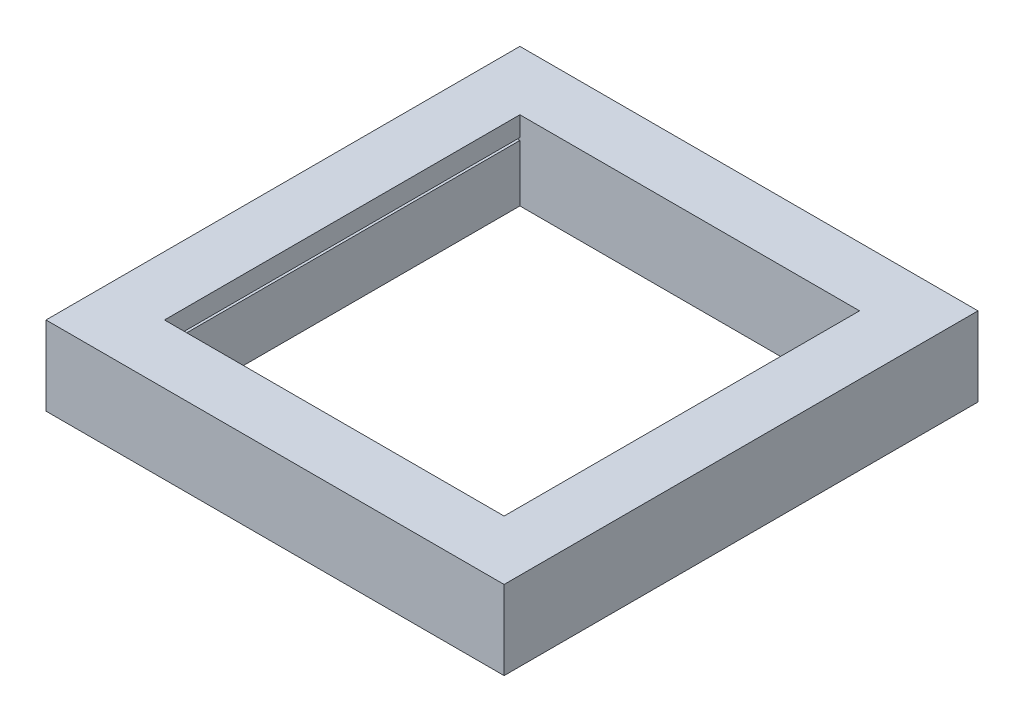
ISO-10303-21;
HEADER;
FILE_DESCRIPTION(('STEP AP214'),'2;1');
FILE_NAME('part.step','',(''),(''),'','','');
FILE_SCHEMA(('AUTOMOTIVE_DESIGN { 1 0 10303 214 1 1 1 1 }'));
ENDSEC;
DATA;
#1=APPLICATION_CONTEXT('core data for automotive mechanical design processes');
#2=APPLICATION_PROTOCOL_DEFINITION('international standard','automotive_design',2000,#1);
#3=PRODUCT_CONTEXT('',#1,'mechanical');
#4=PRODUCT('Part','Part','',(#3));
#5=PRODUCT_RELATED_PRODUCT_CATEGORY('part','',(#4));
#6=PRODUCT_DEFINITION_FORMATION('','',#4);
#7=PRODUCT_DEFINITION_CONTEXT('part definition',#1,'design');
#8=PRODUCT_DEFINITION('design','',#6,#7);
#9=PRODUCT_DEFINITION_SHAPE('','',#8);
#10=(LENGTH_UNIT() NAMED_UNIT(*) SI_UNIT(.MILLI.,.METRE.));
#11=(NAMED_UNIT(*) PLANE_ANGLE_UNIT() SI_UNIT($,.RADIAN.));
#12=(NAMED_UNIT(*) SI_UNIT($,.STERADIAN.) SOLID_ANGLE_UNIT());
#13=UNCERTAINTY_MEASURE_WITH_UNIT(LENGTH_MEASURE(1.E-05),#10,'distance_accuracy_value','');
#14=(GEOMETRIC_REPRESENTATION_CONTEXT(3) GLOBAL_UNCERTAINTY_ASSIGNED_CONTEXT((#13)) GLOBAL_UNIT_ASSIGNED_CONTEXT((#10,
#11,#12)) REPRESENTATION_CONTEXT('',''));
#15=CARTESIAN_POINT('',(0.,0.,0.));
#16=DIRECTION('',(0.,0.,1.));
#17=DIRECTION('',(1.,0.,0.));
#18=AXIS2_PLACEMENT_3D('',#15,#16,#17);
#19=CARTESIAN_POINT('',(109.22,50.8,0.));
#20=DIRECTION('',(-1.,0.,0.));
#21=DIRECTION('',(0.,0.,1.));
#22=AXIS2_PLACEMENT_3D('',#19,#20,#21);
#23=PLANE('',#22);
#24=DIRECTION('',(0.,-1.,0.));
#25=VECTOR('',#24,1.);
#26=CARTESIAN_POINT('',(109.22,50.8,114.3));
#27=LINE('',#26,#25);
#28=CARTESIAN_POINT('',(109.22,36.4998,114.3));
#29=VERTEX_POINT('',#28);
#30=CARTESIAN_POINT('',(109.22,0.,114.3));
#31=VERTEX_POINT('',#30);
#32=EDGE_CURVE('E265',#29,#31,#27,.T.);
#33=ORIENTED_EDGE('',*,*,#32,.F.);
#34=DIRECTION('',(0.,0.,-1.));
#35=VECTOR('',#34,1.);
#36=CARTESIAN_POINT('',(109.22,36.4998,114.3));
#37=LINE('',#36,#35);
#38=CARTESIAN_POINT('',(109.22,36.4998,-114.3));
#39=VERTEX_POINT('',#38);
#40=EDGE_CURVE('E169',#29,#39,#37,.T.);
#41=ORIENTED_EDGE('',*,*,#40,.T.);
#42=DIRECTION('',(0.,-1.,0.));
#43=VECTOR('',#42,1.);
#44=CARTESIAN_POINT('',(109.22,50.8,-114.3));
#45=LINE('',#44,#43);
#46=CARTESIAN_POINT('',(109.22,0.,-114.3));
#47=VERTEX_POINT('',#46);
#48=EDGE_CURVE('E228',#39,#47,#45,.T.);
#49=ORIENTED_EDGE('',*,*,#48,.T.);
#50=DIRECTION('',(0.,0.,-1.));
#51=VECTOR('',#50,1.);
#52=CARTESIAN_POINT('',(109.22,0.,0.));
#53=LINE('',#52,#51);
#54=EDGE_CURVE('E201',#31,#47,#53,.T.);
#55=ORIENTED_EDGE('',*,*,#54,.F.);
#56=EDGE_LOOP('',(#33,#41,#49,#55));
#57=FACE_BOUND('',#56,.T.);
#58=ADVANCED_FACE('F34',(#57),#23,.T.);
#59=CARTESIAN_POINT('',(109.22,50.8,-114.3));
#60=VERTEX_POINT('',#59);
#61=CARTESIAN_POINT('',(109.22,38.1,-114.3));
#62=VERTEX_POINT('',#61);
#63=EDGE_CURVE('E256',#60,#62,#45,.T.);
#64=ORIENTED_EDGE('',*,*,#63,.T.);
#65=DIRECTION('',(0.,0.,1.));
#66=VECTOR('',#65,1.);
#67=CARTESIAN_POINT('',(109.22,38.1,114.3));
#68=LINE('',#67,#66);
#69=CARTESIAN_POINT('',(109.22,38.1,114.3));
#70=VERTEX_POINT('',#69);
#71=EDGE_CURVE('E50',#62,#70,#68,.T.);
#72=ORIENTED_EDGE('',*,*,#71,.T.);
#73=CARTESIAN_POINT('',(109.22,50.8,114.3));
#74=VERTEX_POINT('',#73);
#75=EDGE_CURVE('E37',#74,#70,#27,.T.);
#76=ORIENTED_EDGE('',*,*,#75,.F.);
#77=DIRECTION('',(0.,0.,-1.));
#78=VECTOR('',#77,1.);
#79=CARTESIAN_POINT('',(109.22,50.8,0.));
#80=LINE('',#79,#78);
#81=EDGE_CURVE('E207',#74,#60,#80,.T.);
#82=ORIENTED_EDGE('',*,*,#81,.T.);
#83=EDGE_LOOP('',(#64,#72,#76,#82));
#84=FACE_BOUND('',#83,.T.);
#85=ADVANCED_FACE('F302',(#84),#23,.T.);
#86=CARTESIAN_POINT('',(-109.22,50.8,0.));
#87=DIRECTION('',(1.,0.,0.));
#88=DIRECTION('',(0.,0.,-1.));
#89=AXIS2_PLACEMENT_3D('',#86,#87,#88);
#90=PLANE('',#89);
#91=DIRECTION('',(0.,0.,1.));
#92=VECTOR('',#91,1.);
#93=CARTESIAN_POINT('',(-109.22,38.1,114.3));
#94=LINE('',#93,#92);
#95=CARTESIAN_POINT('',(-109.22,38.1,-114.3));
#96=VERTEX_POINT('',#95);
#97=CARTESIAN_POINT('',(-109.22,38.1,114.3));
#98=VERTEX_POINT('',#97);
#99=EDGE_CURVE('E186',#96,#98,#94,.T.);
#100=ORIENTED_EDGE('',*,*,#99,.F.);
#101=DIRECTION('',(0.,-1.,0.));
#102=VECTOR('',#101,1.);
#103=CARTESIAN_POINT('',(-109.22,50.8,-114.3));
#104=LINE('',#103,#102);
#105=CARTESIAN_POINT('',(-109.22,50.8,-114.3));
#106=VERTEX_POINT('',#105);
#107=EDGE_CURVE('E260',#106,#96,#104,.T.);
#108=ORIENTED_EDGE('',*,*,#107,.F.);
#109=DIRECTION('',(0.,0.,1.));
#110=VECTOR('',#109,1.);
#111=CARTESIAN_POINT('',(-109.22,50.8,0.));
#112=LINE('',#111,#110);
#113=CARTESIAN_POINT('',(-109.22,50.8,114.3));
#114=VERTEX_POINT('',#113);
#115=EDGE_CURVE('E213',#106,#114,#112,.T.);
#116=ORIENTED_EDGE('',*,*,#115,.T.);
#117=DIRECTION('',(0.,-1.,0.));
#118=VECTOR('',#117,1.);
#119=CARTESIAN_POINT('',(-109.22,50.8,114.3));
#120=LINE('',#119,#118);
#121=EDGE_CURVE('E263',#114,#98,#120,.T.);
#122=ORIENTED_EDGE('',*,*,#121,.T.);
#123=EDGE_LOOP('',(#100,#108,#116,#122));
#124=FACE_BOUND('',#123,.T.);
#125=ADVANCED_FACE('F293',(#124),#90,.T.);
#126=CARTESIAN_POINT('',(0.,50.8,152.4));
#127=DIRECTION('',(0.,0.,-1.));
#128=DIRECTION('',(-1.,0.,0.));
#129=AXIS2_PLACEMENT_3D('',#126,#127,#128);
#130=PLANE('',#129);
#131=DIRECTION('',(1.,0.,0.));
#132=VECTOR('',#131,1.);
#133=CARTESIAN_POINT('',(0.,0.,152.4));
#134=LINE('',#133,#132);
#135=CARTESIAN_POINT('',(-147.32,0.,152.4));
#136=VERTEX_POINT('',#135);
#137=CARTESIAN_POINT('',(147.32,0.,152.4));
#138=VERTEX_POINT('',#137);
#139=EDGE_CURVE('E240',#136,#138,#134,.T.);
#140=ORIENTED_EDGE('',*,*,#139,.T.);
#141=DIRECTION('',(0.,-1.,0.));
#142=VECTOR('',#141,1.);
#143=CARTESIAN_POINT('',(147.32,50.8,152.4));
#144=LINE('',#143,#142);
#145=CARTESIAN_POINT('',(147.32,50.8,152.4));
#146=VERTEX_POINT('',#145);
#147=EDGE_CURVE('E11',#146,#138,#144,.T.);
#148=ORIENTED_EDGE('',*,*,#147,.F.);
#149=DIRECTION('',(1.,0.,0.));
#150=VECTOR('',#149,1.);
#151=CARTESIAN_POINT('',(0.,50.8,152.4));
#152=LINE('',#151,#150);
#153=CARTESIAN_POINT('',(-147.32,50.8,152.4));
#154=VERTEX_POINT('',#153);
#155=EDGE_CURVE('E218',#154,#146,#152,.T.);
#156=ORIENTED_EDGE('',*,*,#155,.F.);
#157=DIRECTION('',(0.,-1.,0.));
#158=VECTOR('',#157,1.);
#159=CARTESIAN_POINT('',(-147.32,50.8,152.4));
#160=LINE('',#159,#158);
#161=EDGE_CURVE('E250',#154,#136,#160,.T.);
#162=ORIENTED_EDGE('',*,*,#161,.T.);
#163=EDGE_LOOP('',(#140,#148,#156,#162));
#164=FACE_BOUND('',#163,.T.);
#165=ADVANCED_FACE('F308',(#164),#130,.F.);
#166=CARTESIAN_POINT('',(147.32,50.8,0.));
#167=DIRECTION('',(-1.,0.,0.));
#168=DIRECTION('',(0.,0.,1.));
#169=AXIS2_PLACEMENT_3D('',#166,#167,#168);
#170=PLANE('',#169);
#171=DIRECTION('',(0.,0.,-1.));
#172=VECTOR('',#171,1.);
#173=CARTESIAN_POINT('',(147.32,0.,0.));
#174=LINE('',#173,#172);
#175=CARTESIAN_POINT('',(147.32,0.,-152.4));
#176=VERTEX_POINT('',#175);
#177=EDGE_CURVE('E243',#138,#176,#174,.T.);
#178=ORIENTED_EDGE('',*,*,#177,.T.);
#179=DIRECTION('',(0.,-1.,0.));
#180=VECTOR('',#179,1.);
#181=CARTESIAN_POINT('',(147.32,50.8,-152.4));
#182=LINE('',#181,#180);
#183=CARTESIAN_POINT('',(147.32,50.8,-152.4));
#184=VERTEX_POINT('',#183);
#185=EDGE_CURVE('E42',#184,#176,#182,.T.);
#186=ORIENTED_EDGE('',*,*,#185,.F.);
#187=DIRECTION('',(0.,0.,-1.));
#188=VECTOR('',#187,1.);
#189=CARTESIAN_POINT('',(147.32,50.8,0.));
#190=LINE('',#189,#188);
#191=EDGE_CURVE('E221',#146,#184,#190,.T.);
#192=ORIENTED_EDGE('',*,*,#191,.F.);
#193=ORIENTED_EDGE('',*,*,#147,.T.);
#194=EDGE_LOOP('',(#178,#186,#192,#193));
#195=FACE_BOUND('',#194,.T.);
#196=ADVANCED_FACE('F340',(#195),#170,.F.);
#197=CARTESIAN_POINT('',(0.,50.8,-152.4));
#198=DIRECTION('',(0.,0.,-1.));
#199=DIRECTION('',(-1.,0.,0.));
#200=AXIS2_PLACEMENT_3D('',#197,#198,#199);
#201=PLANE('',#200);
#202=DIRECTION('',(1.,0.,0.));
#203=VECTOR('',#202,1.);
#204=CARTESIAN_POINT('',(0.,0.,-152.4));
#205=LINE('',#204,#203);
#206=CARTESIAN_POINT('',(-147.32,0.,-152.4));
#207=VERTEX_POINT('',#206);
#208=EDGE_CURVE('E246',#207,#176,#205,.T.);
#209=ORIENTED_EDGE('',*,*,#208,.F.);
#210=DIRECTION('',(0.,-1.,0.));
#211=VECTOR('',#210,1.);
#212=CARTESIAN_POINT('',(-147.32,50.8,-152.4));
#213=LINE('',#212,#211);
#214=CARTESIAN_POINT('',(-147.32,50.8,-152.4));
#215=VERTEX_POINT('',#214);
#216=EDGE_CURVE('E253',#215,#207,#213,.T.);
#217=ORIENTED_EDGE('',*,*,#216,.F.);
#218=DIRECTION('',(1.,0.,0.));
#219=VECTOR('',#218,1.);
#220=CARTESIAN_POINT('',(0.,50.8,-152.4));
#221=LINE('',#220,#219);
#222=EDGE_CURVE('E223',#215,#184,#221,.T.);
#223=ORIENTED_EDGE('',*,*,#222,.T.);
#224=ORIENTED_EDGE('',*,*,#185,.T.);
#225=EDGE_LOOP('',(#209,#217,#223,#224));
#226=FACE_BOUND('',#225,.T.);
#227=ADVANCED_FACE('F337',(#226),#201,.T.);
#228=CARTESIAN_POINT('',(0.,50.8,114.3));
#229=DIRECTION('',(0.,0.,-1.));
#230=DIRECTION('',(-1.,0.,0.));
#231=AXIS2_PLACEMENT_3D('',#228,#229,#230);
#232=PLANE('',#231);
#233=DIRECTION('',(1.,0.,0.));
#234=VECTOR('',#233,1.);
#235=CARTESIAN_POINT('',(0.,0.,114.3));
#236=LINE('',#235,#234);
#237=CARTESIAN_POINT('',(-109.22,0.,114.3));
#238=VERTEX_POINT('',#237);
#239=EDGE_CURVE('E231',#238,#31,#236,.T.);
#240=ORIENTED_EDGE('',*,*,#239,.F.);
#241=CARTESIAN_POINT('',(-109.22,36.4998,114.3));
#242=VERTEX_POINT('',#241);
#243=EDGE_CURVE('E262',#242,#238,#120,.T.);
#244=ORIENTED_EDGE('',*,*,#243,.F.);
#245=DIRECTION('',(1.,0.,0.));
#246=VECTOR('',#245,1.);
#247=CARTESIAN_POINT('',(-114.3,36.4998,114.3));
#248=LINE('',#247,#246);
#249=CARTESIAN_POINT('',(-114.3,36.4998,114.3));
#250=VERTEX_POINT('',#249);
#251=EDGE_CURVE('E195',#250,#242,#248,.T.);
#252=ORIENTED_EDGE('',*,*,#251,.F.);
#253=DIRECTION('',(0.,-1.,0.));
#254=VECTOR('',#253,1.);
#255=CARTESIAN_POINT('',(-114.3,38.1,114.3));
#256=LINE('',#255,#254);
#257=CARTESIAN_POINT('',(-114.3,38.1,114.3));
#258=VERTEX_POINT('',#257);
#259=EDGE_CURVE('E182',#258,#250,#256,.T.);
#260=ORIENTED_EDGE('',*,*,#259,.F.);
#261=DIRECTION('',(1.,0.,0.));
#262=VECTOR('',#261,1.);
#263=CARTESIAN_POINT('',(-114.3,38.1,114.3));
#264=LINE('',#263,#262);
#265=EDGE_CURVE('E199',#258,#98,#264,.T.);
#266=ORIENTED_EDGE('',*,*,#265,.T.);
#267=ORIENTED_EDGE('',*,*,#121,.F.);
#268=DIRECTION('',(1.,0.,0.));
#269=VECTOR('',#268,1.);
#270=CARTESIAN_POINT('',(0.,50.8,114.3));
#271=LINE('',#270,#269);
#272=EDGE_CURVE('E210',#114,#74,#271,.T.);
#273=ORIENTED_EDGE('',*,*,#272,.T.);
#274=ORIENTED_EDGE('',*,*,#75,.T.);
#275=DIRECTION('',(-1.,0.,0.));
#276=VECTOR('',#275,1.);
#277=CARTESIAN_POINT('',(114.3,38.1,114.3));
#278=LINE('',#277,#276);
#279=CARTESIAN_POINT('',(114.3,38.1,114.3));
#280=VERTEX_POINT('',#279);
#281=EDGE_CURVE('E150',#280,#70,#278,.T.);
#282=ORIENTED_EDGE('',*,*,#281,.F.);
#283=DIRECTION('',(0.,-1.,0.));
#284=VECTOR('',#283,1.);
#285=CARTESIAN_POINT('',(114.3,38.1,114.3));
#286=LINE('',#285,#284);
#287=CARTESIAN_POINT('',(114.3,36.4998,114.3));
#288=VERTEX_POINT('',#287);
#289=EDGE_CURVE('E156',#280,#288,#286,.T.);
#290=ORIENTED_EDGE('',*,*,#289,.T.);
#291=DIRECTION('',(-1.,0.,0.));
#292=VECTOR('',#291,1.);
#293=CARTESIAN_POINT('',(114.3,36.4998,114.3));
#294=LINE('',#293,#292);
#295=EDGE_CURVE('E177',#288,#29,#294,.T.);
#296=ORIENTED_EDGE('',*,*,#295,.T.);
#297=ORIENTED_EDGE('',*,*,#32,.T.);
#298=EDGE_LOOP('',(#240,#244,#252,#260,#266,#267,#273,#274,#282,#290,#296,#297));
#299=FACE_BOUND('',#298,.T.);
#300=ADVANCED_FACE('F162',(#299),#232,.T.);
#301=DIRECTION('',(0.,0.,-1.));
#302=VECTOR('',#301,1.);
#303=CARTESIAN_POINT('',(-109.22,36.4998,114.3));
#304=LINE('',#303,#302);
#305=CARTESIAN_POINT('',(-109.22,36.4998,-114.3));
#306=VERTEX_POINT('',#305);
#307=EDGE_CURVE('E58',#242,#306,#304,.T.);
#308=ORIENTED_EDGE('',*,*,#307,.F.);
#309=ORIENTED_EDGE('',*,*,#243,.T.);
#310=DIRECTION('',(0.,0.,1.));
#311=VECTOR('',#310,1.);
#312=CARTESIAN_POINT('',(-109.22,0.,0.));
#313=LINE('',#312,#311);
#314=CARTESIAN_POINT('',(-109.22,0.,-114.3));
#315=VERTEX_POINT('',#314);
#316=EDGE_CURVE('E234',#315,#238,#313,.T.);
#317=ORIENTED_EDGE('',*,*,#316,.F.);
#318=EDGE_CURVE('E259',#306,#315,#104,.T.);
#319=ORIENTED_EDGE('',*,*,#318,.F.);
#320=EDGE_LOOP('',(#308,#309,#317,#319));
#321=FACE_BOUND('',#320,.T.);
#322=ADVANCED_FACE('F271',(#321),#90,.T.);
#323=CARTESIAN_POINT('',(0.,50.8,-114.3));
#324=DIRECTION('',(0.,0.,-1.));
#325=DIRECTION('',(-1.,0.,0.));
#326=AXIS2_PLACEMENT_3D('',#323,#324,#325);
#327=PLANE('',#326);
#328=DIRECTION('',(1.,0.,0.));
#329=VECTOR('',#328,1.);
#330=CARTESIAN_POINT('',(0.,0.,-114.3));
#331=LINE('',#330,#329);
#332=EDGE_CURVE('E237',#315,#47,#331,.T.);
#333=ORIENTED_EDGE('',*,*,#332,.T.);
#334=ORIENTED_EDGE('',*,*,#48,.F.);
#335=DIRECTION('',(-1.,0.,0.));
#336=VECTOR('',#335,1.);
#337=CARTESIAN_POINT('',(114.3,36.4998,-114.3));
#338=LINE('',#337,#336);
#339=CARTESIAN_POINT('',(114.3,36.4998,-114.3));
#340=VERTEX_POINT('',#339);
#341=EDGE_CURVE('E179',#340,#39,#338,.T.);
#342=ORIENTED_EDGE('',*,*,#341,.F.);
#343=DIRECTION('',(0.,1.,0.));
#344=VECTOR('',#343,1.);
#345=CARTESIAN_POINT('',(114.3,38.1,-114.3));
#346=LINE('',#345,#344);
#347=CARTESIAN_POINT('',(114.3,38.1,-114.3));
#348=VERTEX_POINT('',#347);
#349=EDGE_CURVE('E155',#340,#348,#346,.T.);
#350=ORIENTED_EDGE('',*,*,#349,.T.);
#351=DIRECTION('',(-1.,0.,0.));
#352=VECTOR('',#351,1.);
#353=CARTESIAN_POINT('',(114.3,38.1,-114.3));
#354=LINE('',#353,#352);
#355=EDGE_CURVE('E151',#348,#62,#354,.T.);
#356=ORIENTED_EDGE('',*,*,#355,.T.);
#357=ORIENTED_EDGE('',*,*,#63,.F.);
#358=DIRECTION('',(1.,0.,0.));
#359=VECTOR('',#358,1.);
#360=CARTESIAN_POINT('',(0.,50.8,-114.3));
#361=LINE('',#360,#359);
#362=EDGE_CURVE('E216',#106,#60,#361,.T.);
#363=ORIENTED_EDGE('',*,*,#362,.F.);
#364=ORIENTED_EDGE('',*,*,#107,.T.);
#365=DIRECTION('',(1.,0.,0.));
#366=VECTOR('',#365,1.);
#367=CARTESIAN_POINT('',(-114.3,38.1,-114.3));
#368=LINE('',#367,#366);
#369=CARTESIAN_POINT('',(-114.3,38.1,-114.3));
#370=VERTEX_POINT('',#369);
#371=EDGE_CURVE('E202',#370,#96,#368,.T.);
#372=ORIENTED_EDGE('',*,*,#371,.F.);
#373=DIRECTION('',(0.,1.,0.));
#374=VECTOR('',#373,1.);
#375=CARTESIAN_POINT('',(-114.3,38.1,-114.3));
#376=LINE('',#375,#374);
#377=CARTESIAN_POINT('',(-114.3,36.4998,-114.3));
#378=VERTEX_POINT('',#377);
#379=EDGE_CURVE('E189',#378,#370,#376,.T.);
#380=ORIENTED_EDGE('',*,*,#379,.F.);
#381=DIRECTION('',(1.,0.,0.));
#382=VECTOR('',#381,1.);
#383=CARTESIAN_POINT('',(-114.3,36.4998,-114.3));
#384=LINE('',#383,#382);
#385=EDGE_CURVE('E204',#378,#306,#384,.T.);
#386=ORIENTED_EDGE('',*,*,#385,.T.);
#387=ORIENTED_EDGE('',*,*,#318,.T.);
#388=EDGE_LOOP('',(#333,#334,#342,#350,#356,#357,#363,#364,#372,#380,#386,#387));
#389=FACE_BOUND('',#388,.T.);
#390=ADVANCED_FACE('F281',(#389),#327,.F.);
#391=CARTESIAN_POINT('',(-147.32,50.8,0.));
#392=DIRECTION('',(1.,0.,0.));
#393=DIRECTION('',(0.,0.,-1.));
#394=AXIS2_PLACEMENT_3D('',#391,#392,#393);
#395=PLANE('',#394);
#396=DIRECTION('',(0.,0.,1.));
#397=VECTOR('',#396,1.);
#398=CARTESIAN_POINT('',(-147.32,0.,0.));
#399=LINE('',#398,#397);
#400=EDGE_CURVE('E211',#207,#136,#399,.T.);
#401=ORIENTED_EDGE('',*,*,#400,.T.);
#402=ORIENTED_EDGE('',*,*,#161,.F.);
#403=DIRECTION('',(0.,0.,1.));
#404=VECTOR('',#403,1.);
#405=CARTESIAN_POINT('',(-147.32,50.8,0.));
#406=LINE('',#405,#404);
#407=EDGE_CURVE('E226',#215,#154,#406,.T.);
#408=ORIENTED_EDGE('',*,*,#407,.F.);
#409=ORIENTED_EDGE('',*,*,#216,.T.);
#410=EDGE_LOOP('',(#401,#402,#408,#409));
#411=FACE_BOUND('',#410,.T.);
#412=ADVANCED_FACE('F331',(#411),#395,.F.);
#413=CARTESIAN_POINT('',(0.,50.8,0.));
#414=DIRECTION('',(0.,1.,0.));
#415=DIRECTION('',(0.,0.,1.));
#416=AXIS2_PLACEMENT_3D('',#413,#414,#415);
#417=PLANE('',#416);
#418=ORIENTED_EDGE('',*,*,#81,.F.);
#419=ORIENTED_EDGE('',*,*,#272,.F.);
#420=ORIENTED_EDGE('',*,*,#115,.F.);
#421=ORIENTED_EDGE('',*,*,#362,.T.);
#422=EDGE_LOOP('',(#418,#419,#420,#421));
#423=FACE_BOUND('',#422,.T.);
#424=ORIENTED_EDGE('',*,*,#155,.T.);
#425=ORIENTED_EDGE('',*,*,#191,.T.);
#426=ORIENTED_EDGE('',*,*,#222,.F.);
#427=ORIENTED_EDGE('',*,*,#407,.T.);
#428=EDGE_LOOP('',(#424,#425,#426,#427));
#429=FACE_BOUND('',#428,.T.);
#430=ADVANCED_FACE('F299',(#423,#429),#417,.T.);
#431=CARTESIAN_POINT('',(0.,0.,0.));
#432=DIRECTION('',(0.,1.,0.));
#433=DIRECTION('',(0.,0.,1.));
#434=AXIS2_PLACEMENT_3D('',#431,#432,#433);
#435=PLANE('',#434);
#436=ORIENTED_EDGE('',*,*,#54,.T.);
#437=ORIENTED_EDGE('',*,*,#332,.F.);
#438=ORIENTED_EDGE('',*,*,#316,.T.);
#439=ORIENTED_EDGE('',*,*,#239,.T.);
#440=EDGE_LOOP('',(#436,#437,#438,#439));
#441=FACE_BOUND('',#440,.T.);
#442=ORIENTED_EDGE('',*,*,#139,.F.);
#443=ORIENTED_EDGE('',*,*,#400,.F.);
#444=ORIENTED_EDGE('',*,*,#208,.T.);
#445=ORIENTED_EDGE('',*,*,#177,.F.);
#446=EDGE_LOOP('',(#442,#443,#444,#445));
#447=FACE_BOUND('',#446,.T.);
#448=ADVANCED_FACE('F277',(#441,#447),#435,.F.);
#449=CARTESIAN_POINT('',(-114.3,38.1,114.3));
#450=DIRECTION('',(0.,1.,0.));
#451=DIRECTION('',(0.,0.,1.));
#452=AXIS2_PLACEMENT_3D('',#449,#450,#451);
#453=PLANE('',#452);
#454=ORIENTED_EDGE('',*,*,#99,.T.);
#455=ORIENTED_EDGE('',*,*,#265,.F.);
#456=DIRECTION('',(0.,0.,1.));
#457=VECTOR('',#456,1.);
#458=CARTESIAN_POINT('',(-114.3,38.1,114.3));
#459=LINE('',#458,#457);
#460=EDGE_CURVE('E192',#370,#258,#459,.T.);
#461=ORIENTED_EDGE('',*,*,#460,.F.);
#462=ORIENTED_EDGE('',*,*,#371,.T.);
#463=EDGE_LOOP('',(#454,#455,#461,#462));
#464=FACE_BOUND('',#463,.T.);
#465=ADVANCED_FACE('F292',(#464),#453,.F.);
#466=CARTESIAN_POINT('',(-114.3,36.4998,114.3));
#467=DIRECTION('',(0.,-1.,0.));
#468=DIRECTION('',(0.,0.,-1.));
#469=AXIS2_PLACEMENT_3D('',#466,#467,#468);
#470=PLANE('',#469);
#471=ORIENTED_EDGE('',*,*,#307,.T.);
#472=ORIENTED_EDGE('',*,*,#385,.F.);
#473=DIRECTION('',(0.,0.,-1.));
#474=VECTOR('',#473,1.);
#475=CARTESIAN_POINT('',(-114.3,36.4998,114.3));
#476=LINE('',#475,#474);
#477=EDGE_CURVE('E185',#250,#378,#476,.T.);
#478=ORIENTED_EDGE('',*,*,#477,.F.);
#479=ORIENTED_EDGE('',*,*,#251,.T.);
#480=EDGE_LOOP('',(#471,#472,#478,#479));
#481=FACE_BOUND('',#480,.T.);
#482=ADVANCED_FACE('F285',(#481),#470,.F.);
#483=CARTESIAN_POINT('',(-114.3,0.,0.));
#484=DIRECTION('',(1.,0.,0.));
#485=DIRECTION('',(0.,0.,-1.));
#486=AXIS2_PLACEMENT_3D('',#483,#484,#485);
#487=PLANE('',#486);
#488=ORIENTED_EDGE('',*,*,#259,.T.);
#489=ORIENTED_EDGE('',*,*,#477,.T.);
#490=ORIENTED_EDGE('',*,*,#379,.T.);
#491=ORIENTED_EDGE('',*,*,#460,.T.);
#492=EDGE_LOOP('',(#488,#489,#490,#491));
#493=FACE_BOUND('',#492,.T.);
#494=ADVANCED_FACE('F288',(#493),#487,.T.);
#495=CARTESIAN_POINT('',(114.3,36.4998,114.3));
#496=DIRECTION('',(0.,1.,0.));
#497=DIRECTION('',(0.,0.,1.));
#498=AXIS2_PLACEMENT_3D('',#495,#496,#497);
#499=PLANE('',#498);
#500=ORIENTED_EDGE('',*,*,#40,.F.);
#501=ORIENTED_EDGE('',*,*,#295,.F.);
#502=DIRECTION('',(0.,0.,-1.));
#503=VECTOR('',#502,1.);
#504=CARTESIAN_POINT('',(114.3,36.4998,114.3));
#505=LINE('',#504,#503);
#506=EDGE_CURVE('E166',#288,#340,#505,.T.);
#507=ORIENTED_EDGE('',*,*,#506,.T.);
#508=ORIENTED_EDGE('',*,*,#341,.T.);
#509=EDGE_LOOP('',(#500,#501,#507,#508));
#510=FACE_BOUND('',#509,.T.);
#511=ADVANCED_FACE('F314',(#510),#499,.T.);
#512=CARTESIAN_POINT('',(114.3,38.1,114.3));
#513=DIRECTION('',(0.,-1.,0.));
#514=DIRECTION('',(0.,0.,-1.));
#515=AXIS2_PLACEMENT_3D('',#512,#513,#514);
#516=PLANE('',#515);
#517=ORIENTED_EDGE('',*,*,#71,.F.);
#518=ORIENTED_EDGE('',*,*,#355,.F.);
#519=DIRECTION('',(0.,0.,1.));
#520=VECTOR('',#519,1.);
#521=CARTESIAN_POINT('',(114.3,38.1,114.3));
#522=LINE('',#521,#520);
#523=EDGE_CURVE('E147',#348,#280,#522,.T.);
#524=ORIENTED_EDGE('',*,*,#523,.T.);
#525=ORIENTED_EDGE('',*,*,#281,.T.);
#526=EDGE_LOOP('',(#517,#518,#524,#525));
#527=FACE_BOUND('',#526,.T.);
#528=ADVANCED_FACE('F149',(#527),#516,.T.);
#529=CARTESIAN_POINT('',(114.3,0.,0.));
#530=DIRECTION('',(-1.,0.,0.));
#531=DIRECTION('',(0.,0.,-1.));
#532=AXIS2_PLACEMENT_3D('',#529,#530,#531);
#533=PLANE('',#532);
#534=ORIENTED_EDGE('',*,*,#289,.F.);
#535=ORIENTED_EDGE('',*,*,#523,.F.);
#536=ORIENTED_EDGE('',*,*,#349,.F.);
#537=ORIENTED_EDGE('',*,*,#506,.F.);
#538=EDGE_LOOP('',(#534,#535,#536,#537));
#539=FACE_BOUND('',#538,.T.);
#540=ADVANCED_FACE('F168',(#539),#533,.T.);
#541=CLOSED_SHELL('',(#58,#85,#125,#165,#196,#227,#300,#322,#390,#412,#430,#448,#465,#482,#494,
#511,#528,#540));
#542=MANIFOLD_SOLID_BREP('B2',#541);
#543=ADVANCED_BREP_SHAPE_REPRESENTATION('',(#18,#542),#14);
#544=SHAPE_DEFINITION_REPRESENTATION(#9,#543);
ENDSEC;
END-ISO-10303-21;
